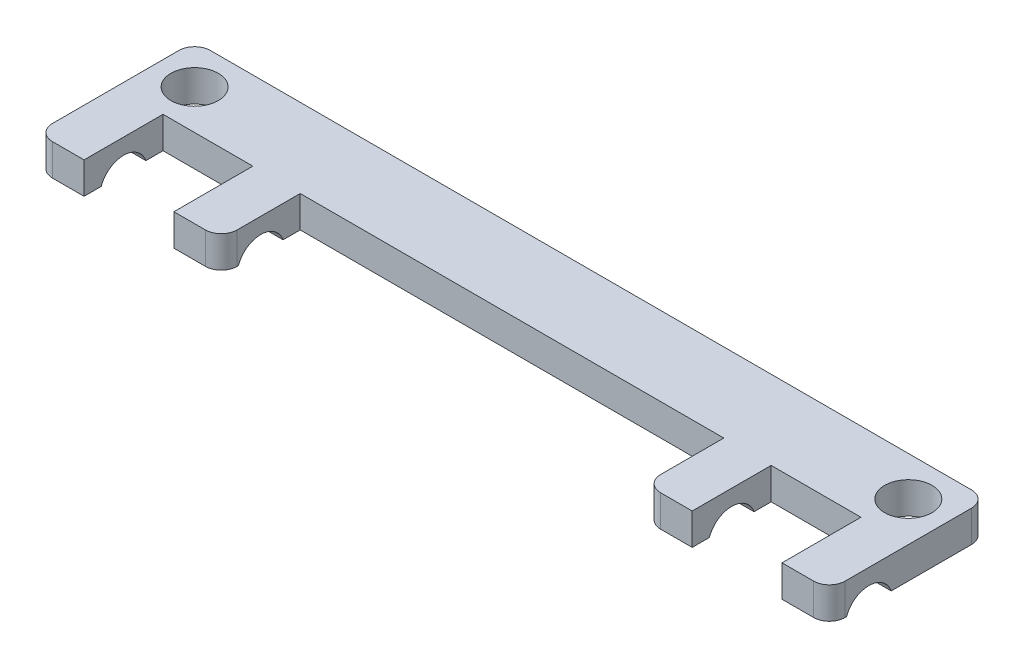
ISO-10303-21;
HEADER;
FILE_DESCRIPTION(('STEP AP214'),'2;1');
FILE_NAME('part.step','',(''),(''),'','','');
FILE_SCHEMA(('AUTOMOTIVE_DESIGN { 1 0 10303 214 1 1 1 1 }'));
ENDSEC;
DATA;
#1=APPLICATION_CONTEXT('core data for automotive mechanical design processes');
#2=APPLICATION_PROTOCOL_DEFINITION('international standard','automotive_design',2000,#1);
#3=PRODUCT_CONTEXT('',#1,'mechanical');
#4=PRODUCT('Part','Part','',(#3));
#5=PRODUCT_RELATED_PRODUCT_CATEGORY('part','',(#4));
#6=PRODUCT_DEFINITION_FORMATION('','',#4);
#7=PRODUCT_DEFINITION_CONTEXT('part definition',#1,'design');
#8=PRODUCT_DEFINITION('design','',#6,#7);
#9=PRODUCT_DEFINITION_SHAPE('','',#8);
#10=(LENGTH_UNIT() NAMED_UNIT(*) SI_UNIT(.MILLI.,.METRE.));
#11=(NAMED_UNIT(*) PLANE_ANGLE_UNIT() SI_UNIT($,.RADIAN.));
#12=(NAMED_UNIT(*) SI_UNIT($,.STERADIAN.) SOLID_ANGLE_UNIT());
#13=UNCERTAINTY_MEASURE_WITH_UNIT(LENGTH_MEASURE(1.E-05),#10,'distance_accuracy_value','');
#14=(GEOMETRIC_REPRESENTATION_CONTEXT(3) GLOBAL_UNCERTAINTY_ASSIGNED_CONTEXT((#13)) GLOBAL_UNIT_ASSIGNED_CONTEXT((#10,
#11,#12)) REPRESENTATION_CONTEXT('',''));
#15=CARTESIAN_POINT('',(0.,0.,0.));
#16=DIRECTION('',(0.,0.,1.));
#17=DIRECTION('',(1.,0.,0.));
#18=AXIS2_PLACEMENT_3D('',#15,#16,#17);
#19=CARTESIAN_POINT('',(0.,0.,0.));
#20=DIRECTION('',(0.,1.,0.));
#21=DIRECTION('',(0.,0.,1.));
#22=AXIS2_PLACEMENT_3D('',#19,#20,#21);
#23=PLANE('',#22);
#24=CARTESIAN_POINT('',(47.7,0.,-2.5));
#25=DIRECTION('',(0.,1.,0.));
#26=DIRECTION('',(0.,0.,1.));
#27=AXIS2_PLACEMENT_3D('',#24,#25,#26);
#28=CIRCLE('',#27,1.5);
#29=CARTESIAN_POINT('',(47.7,0.,-0.999999999999997));
#30=VERTEX_POINT('',#29);
#31=EDGE_CURVE('E295',#30,#30,#28,.T.);
#32=ORIENTED_EDGE('',*,*,#31,.T.);
#33=EDGE_LOOP('',(#32));
#34=FACE_BOUND('',#33,.T.);
#35=CARTESIAN_POINT('',(2.5,0.,-2.5));
#36=DIRECTION('',(0.,1.,0.));
#37=DIRECTION('',(0.,0.,1.));
#38=AXIS2_PLACEMENT_3D('',#35,#36,#37);
#39=CIRCLE('',#38,1.5);
#40=CARTESIAN_POINT('',(2.5,0.,-1.));
#41=VERTEX_POINT('',#40);
#42=EDGE_CURVE('E301',#41,#41,#39,.T.);
#43=ORIENTED_EDGE('',*,*,#42,.T.);
#44=EDGE_LOOP('',(#43));
#45=FACE_BOUND('',#44,.T.);
#46=DIRECTION('',(0.,0.,-1.));
#47=VECTOR('',#46,1.);
#48=CARTESIAN_POINT('',(0.,0.,0.));
#49=LINE('',#48,#47);
#50=CARTESIAN_POINT('',(0.,0.,1.08578643762691));
#51=VERTEX_POINT('',#50);
#52=CARTESIAN_POINT('',(0.,0.,-4.));
#53=VERTEX_POINT('',#52);
#54=EDGE_CURVE('E250',#51,#53,#49,.T.);
#55=ORIENTED_EDGE('',*,*,#54,.T.);
#56=CARTESIAN_POINT('',(1.,0.,-4.));
#57=DIRECTION('',(0.,1.,0.));
#58=DIRECTION('',(0.,0.,1.));
#59=AXIS2_PLACEMENT_3D('',#56,#57,#58);
#60=CIRCLE('',#59,1.);
#61=CARTESIAN_POINT('',(1.,0.,-5.));
#62=VERTEX_POINT('',#61);
#63=EDGE_CURVE('E481',#53,#62,#60,.F.);
#64=ORIENTED_EDGE('',*,*,#63,.T.);
#65=DIRECTION('',(1.,0.,0.));
#66=VECTOR('',#65,1.);
#67=CARTESIAN_POINT('',(0.,0.,-5.));
#68=LINE('',#67,#66);
#69=CARTESIAN_POINT('',(49.2,0.,-5.));
#70=VERTEX_POINT('',#69);
#71=EDGE_CURVE('E367',#62,#70,#68,.T.);
#72=ORIENTED_EDGE('',*,*,#71,.T.);
#73=CARTESIAN_POINT('',(49.2,0.,-4.));
#74=DIRECTION('',(0.,1.,0.));
#75=DIRECTION('',(0.,0.,1.));
#76=AXIS2_PLACEMENT_3D('',#73,#74,#75);
#77=CIRCLE('',#76,1.);
#78=CARTESIAN_POINT('',(50.2,0.,-4.));
#79=VERTEX_POINT('',#78);
#80=EDGE_CURVE('E478',#70,#79,#77,.F.);
#81=ORIENTED_EDGE('',*,*,#80,.T.);
#82=DIRECTION('',(0.,0.,-1.));
#83=VECTOR('',#82,1.);
#84=CARTESIAN_POINT('',(50.2,0.,0.));
#85=LINE('',#84,#83);
#86=CARTESIAN_POINT('',(50.2,0.,1.08578643762691));
#87=VERTEX_POINT('',#86);
#88=EDGE_CURVE('E422',#87,#79,#85,.T.);
#89=ORIENTED_EDGE('',*,*,#88,.F.);
#90=DIRECTION('',(-1.,0.,0.));
#91=VECTOR('',#90,1.);
#92=CARTESIAN_POINT('',(55.,0.,1.08578643762691));
#93=LINE('',#92,#91);
#94=CARTESIAN_POINT('',(47.2,0.,1.08578643762691));
#95=VERTEX_POINT('',#94);
#96=EDGE_CURVE('E471',#87,#95,#93,.T.);
#97=ORIENTED_EDGE('',*,*,#96,.T.);
#98=DIRECTION('',(0.,0.,1.));
#99=VECTOR('',#98,1.);
#100=CARTESIAN_POINT('',(47.2,0.,0.));
#101=LINE('',#100,#99);
#102=CARTESIAN_POINT('',(47.2,0.,0.));
#103=VERTEX_POINT('',#102);
#104=EDGE_CURVE('E414',#103,#95,#101,.T.);
#105=ORIENTED_EDGE('',*,*,#104,.F.);
#106=DIRECTION('',(1.,0.,0.));
#107=VECTOR('',#106,1.);
#108=CARTESIAN_POINT('',(0.,0.,0.));
#109=LINE('',#108,#107);
#110=CARTESIAN_POINT('',(41.5127142897757,0.,0.));
#111=VERTEX_POINT('',#110);
#112=EDGE_CURVE('E400',#111,#103,#109,.T.);
#113=ORIENTED_EDGE('',*,*,#112,.F.);
#114=DIRECTION('',(0.,0.,1.));
#115=VECTOR('',#114,1.);
#116=CARTESIAN_POINT('',(41.5127142897757,0.,0.));
#117=LINE('',#116,#115);
#118=CARTESIAN_POINT('',(41.5127142897757,0.,1.08578643762691));
#119=VERTEX_POINT('',#118);
#120=EDGE_CURVE('E410',#111,#119,#117,.T.);
#121=ORIENTED_EDGE('',*,*,#120,.T.);
#122=CARTESIAN_POINT('',(38.5127142897757,0.,1.08578643762691));
#123=VERTEX_POINT('',#122);
#124=EDGE_CURVE('E609',#119,#123,#93,.T.);
#125=ORIENTED_EDGE('',*,*,#124,.T.);
#126=DIRECTION('',(0.,0.,1.));
#127=VECTOR('',#126,1.);
#128=CARTESIAN_POINT('',(38.5127142897757,0.,0.));
#129=LINE('',#128,#127);
#130=CARTESIAN_POINT('',(38.5127142897757,0.,0.));
#131=VERTEX_POINT('',#130);
#132=EDGE_CURVE('E401',#131,#123,#129,.T.);
#133=ORIENTED_EDGE('',*,*,#132,.F.);
#134=CARTESIAN_POINT('',(11.6872857102243,0.,0.));
#135=VERTEX_POINT('',#134);
#136=EDGE_CURVE('E395',#135,#131,#109,.T.);
#137=ORIENTED_EDGE('',*,*,#136,.F.);
#138=DIRECTION('',(0.,0.,1.));
#139=VECTOR('',#138,1.);
#140=CARTESIAN_POINT('',(11.6872857102243,0.,0.));
#141=LINE('',#140,#139);
#142=CARTESIAN_POINT('',(11.6872857102243,0.,1.08578643762691));
#143=VERTEX_POINT('',#142);
#144=EDGE_CURVE('E391',#135,#143,#141,.T.);
#145=ORIENTED_EDGE('',*,*,#144,.T.);
#146=CARTESIAN_POINT('',(8.68728571022433,0.,1.08578643762691));
#147=VERTEX_POINT('',#146);
#148=EDGE_CURVE('E470',#143,#147,#93,.T.);
#149=ORIENTED_EDGE('',*,*,#148,.T.);
#150=DIRECTION('',(0.,0.,1.));
#151=VECTOR('',#150,1.);
#152=CARTESIAN_POINT('',(8.68728571022433,0.,0.));
#153=LINE('',#152,#151);
#154=CARTESIAN_POINT('',(8.68728571022433,0.,0.));
#155=VERTEX_POINT('',#154);
#156=EDGE_CURVE('E383',#155,#147,#153,.T.);
#157=ORIENTED_EDGE('',*,*,#156,.F.);
#158=DIRECTION('',(1.,0.,0.));
#159=VECTOR('',#158,1.);
#160=CARTESIAN_POINT('',(0.,0.,0.));
#161=LINE('',#160,#159);
#162=CARTESIAN_POINT('',(3.,0.,0.));
#163=VERTEX_POINT('',#162);
#164=EDGE_CURVE('E378',#163,#155,#161,.T.);
#165=ORIENTED_EDGE('',*,*,#164,.F.);
#166=DIRECTION('',(0.,0.,1.));
#167=VECTOR('',#166,1.);
#168=CARTESIAN_POINT('',(3.,0.,0.));
#169=LINE('',#168,#167);
#170=CARTESIAN_POINT('',(3.,0.,1.08578643762691));
#171=VERTEX_POINT('',#170);
#172=EDGE_CURVE('E374',#163,#171,#169,.T.);
#173=ORIENTED_EDGE('',*,*,#172,.T.);
#174=EDGE_CURVE('E259',#171,#51,#93,.T.);
#175=ORIENTED_EDGE('',*,*,#174,.T.);
#176=EDGE_LOOP('',(#55,#64,#72,#81,#89,#97,#105,#113,#121,#125,#133,#137,#145,#149,#157,#165,
#173,#175));
#177=FACE_BOUND('',#176,.T.);
#178=ADVANCED_FACE('F41',(#34,#45,#177),#23,.F.);
#179=DIRECTION('',(1.,0.,0.));
#180=VECTOR('',#179,1.);
#181=CARTESIAN_POINT('',(0.,0.,5.));
#182=LINE('',#181,#180);
#183=CARTESIAN_POINT('',(1.,0.,5.));
#184=VERTEX_POINT('',#183);
#185=CARTESIAN_POINT('',(3.,0.,5.));
#186=VERTEX_POINT('',#185);
#187=EDGE_CURVE('E249',#184,#186,#182,.T.);
#188=ORIENTED_EDGE('',*,*,#187,.F.);
#189=CARTESIAN_POINT('',(1.,0.,4.));
#190=DIRECTION('',(0.,1.,0.));
#191=DIRECTION('',(0.,0.,1.));
#192=AXIS2_PLACEMENT_3D('',#189,#190,#191);
#193=CIRCLE('',#192,1.);
#194=CARTESIAN_POINT('',(0.,0.,4.));
#195=VERTEX_POINT('',#194);
#196=EDGE_CURVE('E11',#184,#195,#193,.F.);
#197=ORIENTED_EDGE('',*,*,#196,.T.);
#198=CARTESIAN_POINT('',(0.,0.,3.9142135623731));
#199=VERTEX_POINT('',#198);
#200=EDGE_CURVE('E239',#195,#199,#49,.T.);
#201=ORIENTED_EDGE('',*,*,#200,.T.);
#202=DIRECTION('',(-1.,0.,0.));
#203=VECTOR('',#202,1.);
#204=CARTESIAN_POINT('',(55.,0.,3.9142135623731));
#205=LINE('',#204,#203);
#206=CARTESIAN_POINT('',(3.,0.,3.9142135623731));
#207=VERTEX_POINT('',#206);
#208=EDGE_CURVE('E244',#199,#207,#205,.F.);
#209=ORIENTED_EDGE('',*,*,#208,.T.);
#210=EDGE_CURVE('E373',#207,#186,#169,.T.);
#211=ORIENTED_EDGE('',*,*,#210,.T.);
#212=EDGE_LOOP('',(#188,#197,#201,#209,#211));
#213=FACE_BOUND('',#212,.T.);
#214=ADVANCED_FACE('F242',(#213),#23,.F.);
#215=CARTESIAN_POINT('',(11.6872857102243,0.,3.9142135623731));
#216=VERTEX_POINT('',#215);
#217=CARTESIAN_POINT('',(11.6872857102243,0.,4.));
#218=VERTEX_POINT('',#217);
#219=EDGE_CURVE('E390',#216,#218,#141,.T.);
#220=ORIENTED_EDGE('',*,*,#219,.T.);
#221=CARTESIAN_POINT('',(10.6872857102243,0.,4.));
#222=DIRECTION('',(0.,1.,0.));
#223=DIRECTION('',(0.,0.,1.));
#224=AXIS2_PLACEMENT_3D('',#221,#222,#223);
#225=CIRCLE('',#224,1.);
#226=CARTESIAN_POINT('',(10.6872857102243,0.,5.));
#227=VERTEX_POINT('',#226);
#228=EDGE_CURVE('E63',#218,#227,#225,.F.);
#229=ORIENTED_EDGE('',*,*,#228,.T.);
#230=DIRECTION('',(1.,0.,0.));
#231=VECTOR('',#230,1.);
#232=CARTESIAN_POINT('',(0.,0.,5.));
#233=LINE('',#232,#231);
#234=CARTESIAN_POINT('',(8.68728571022433,0.,5.));
#235=VERTEX_POINT('',#234);
#236=EDGE_CURVE('E387',#235,#227,#233,.T.);
#237=ORIENTED_EDGE('',*,*,#236,.F.);
#238=CARTESIAN_POINT('',(8.68728571022433,0.,3.9142135623731));
#239=VERTEX_POINT('',#238);
#240=EDGE_CURVE('E382',#239,#235,#153,.T.);
#241=ORIENTED_EDGE('',*,*,#240,.F.);
#242=EDGE_CURVE('E260',#239,#216,#205,.F.);
#243=ORIENTED_EDGE('',*,*,#242,.T.);
#244=EDGE_LOOP('',(#220,#229,#237,#241,#243));
#245=FACE_BOUND('',#244,.T.);
#246=ADVANCED_FACE('F595',(#245),#23,.F.);
#247=DIRECTION('',(-1.,0.,0.));
#248=VECTOR('',#247,1.);
#249=CARTESIAN_POINT('',(0.,0.,5.00000000000001));
#250=LINE('',#249,#248);
#251=CARTESIAN_POINT('',(41.5127142897757,0.,5.));
#252=VERTEX_POINT('',#251);
#253=CARTESIAN_POINT('',(39.5127142897757,0.,5.));
#254=VERTEX_POINT('',#253);
#255=EDGE_CURVE('E405',#252,#254,#250,.T.);
#256=ORIENTED_EDGE('',*,*,#255,.T.);
#257=CARTESIAN_POINT('',(39.5127142897757,0.,4.));
#258=DIRECTION('',(0.,1.,0.));
#259=DIRECTION('',(0.,0.,1.));
#260=AXIS2_PLACEMENT_3D('',#257,#258,#259);
#261=CIRCLE('',#260,1.);
#262=CARTESIAN_POINT('',(38.5127142897757,0.,3.99999999999999));
#263=VERTEX_POINT('',#262);
#264=EDGE_CURVE('E526',#254,#263,#261,.F.);
#265=ORIENTED_EDGE('',*,*,#264,.T.);
#266=CARTESIAN_POINT('',(38.5127142897757,0.,3.9142135623731));
#267=VERTEX_POINT('',#266);
#268=EDGE_CURVE('E399',#267,#263,#129,.T.);
#269=ORIENTED_EDGE('',*,*,#268,.F.);
#270=CARTESIAN_POINT('',(41.5127142897757,0.,3.9142135623731));
#271=VERTEX_POINT('',#270);
#272=EDGE_CURVE('E467',#267,#271,#205,.F.);
#273=ORIENTED_EDGE('',*,*,#272,.T.);
#274=EDGE_CURVE('E409',#271,#252,#117,.T.);
#275=ORIENTED_EDGE('',*,*,#274,.T.);
#276=EDGE_LOOP('',(#256,#265,#269,#273,#275));
#277=FACE_BOUND('',#276,.T.);
#278=ADVANCED_FACE('F634',(#277),#23,.F.);
#279=CARTESIAN_POINT('',(0.,2.,-5.));
#280=DIRECTION('',(0.,0.,-1.));
#281=DIRECTION('',(-1.,0.,0.));
#282=AXIS2_PLACEMENT_3D('',#279,#280,#281);
#283=PLANE('',#282);
#284=ORIENTED_EDGE('',*,*,#71,.F.);
#285=DIRECTION('',(0.,-1.,0.));
#286=VECTOR('',#285,1.);
#287=CARTESIAN_POINT('',(1.,2.,-5.));
#288=LINE('',#287,#286);
#289=CARTESIAN_POINT('',(1.,2.,-5.));
#290=VERTEX_POINT('',#289);
#291=EDGE_CURVE('E488',#62,#290,#288,.F.);
#292=ORIENTED_EDGE('',*,*,#291,.T.);
#293=DIRECTION('',(1.,0.,0.));
#294=VECTOR('',#293,1.);
#295=CARTESIAN_POINT('',(0.,2.,-5.));
#296=LINE('',#295,#294);
#297=CARTESIAN_POINT('',(49.2,2.,-5.));
#298=VERTEX_POINT('',#297);
#299=EDGE_CURVE('E300',#290,#298,#296,.T.);
#300=ORIENTED_EDGE('',*,*,#299,.T.);
#301=DIRECTION('',(0.,-1.,0.));
#302=VECTOR('',#301,1.);
#303=CARTESIAN_POINT('',(49.2,0.,-5.));
#304=LINE('',#303,#302);
#305=EDGE_CURVE('E484',#298,#70,#304,.T.);
#306=ORIENTED_EDGE('',*,*,#305,.T.);
#307=EDGE_LOOP('',(#284,#292,#300,#306));
#308=FACE_BOUND('',#307,.T.);
#309=ADVANCED_FACE('F566',(#308),#283,.T.);
#310=CARTESIAN_POINT('',(0.,2.,0.));
#311=DIRECTION('',(-1.,0.,0.));
#312=DIRECTION('',(0.,0.,1.));
#313=AXIS2_PLACEMENT_3D('',#310,#311,#312);
#314=PLANE('',#313);
#315=DIRECTION('',(0.,0.,-1.));
#316=VECTOR('',#315,1.);
#317=CARTESIAN_POINT('',(0.,2.,0.));
#318=LINE('',#317,#316);
#319=CARTESIAN_POINT('',(0.,2.,4.));
#320=VERTEX_POINT('',#319);
#321=CARTESIAN_POINT('',(0.,2.,-4.));
#322=VERTEX_POINT('',#321);
#323=EDGE_CURVE('E305',#320,#322,#318,.T.);
#324=ORIENTED_EDGE('',*,*,#323,.T.);
#325=DIRECTION('',(0.,-1.,0.));
#326=VECTOR('',#325,1.);
#327=CARTESIAN_POINT('',(0.,2.,-4.));
#328=LINE('',#327,#326);
#329=EDGE_CURVE('E475',#322,#53,#328,.T.);
#330=ORIENTED_EDGE('',*,*,#329,.T.);
#331=ORIENTED_EDGE('',*,*,#54,.F.);
#332=CARTESIAN_POINT('',(0.,-0.5,2.5));
#333=DIRECTION('',(-1.,0.,0.));
#334=DIRECTION('',(0.,0.,1.));
#335=AXIS2_PLACEMENT_3D('',#332,#333,#334);
#336=CIRCLE('',#335,1.5);
#337=EDGE_CURVE('E254',#199,#51,#336,.T.);
#338=ORIENTED_EDGE('',*,*,#337,.F.);
#339=ORIENTED_EDGE('',*,*,#200,.F.);
#340=DIRECTION('',(0.,-1.,0.));
#341=VECTOR('',#340,1.);
#342=CARTESIAN_POINT('',(0.,2.,4.));
#343=LINE('',#342,#341);
#344=EDGE_CURVE('E472',#195,#320,#343,.F.);
#345=ORIENTED_EDGE('',*,*,#344,.T.);
#346=EDGE_LOOP('',(#324,#330,#331,#338,#339,#345));
#347=FACE_BOUND('',#346,.T.);
#348=ADVANCED_FACE('F265',(#347),#314,.T.);
#349=CARTESIAN_POINT('',(0.,2.,5.));
#350=DIRECTION('',(0.,0.,-1.));
#351=DIRECTION('',(-1.,0.,0.));
#352=AXIS2_PLACEMENT_3D('',#349,#350,#351);
#353=PLANE('',#352);
#354=DIRECTION('',(1.,0.,0.));
#355=VECTOR('',#354,1.);
#356=CARTESIAN_POINT('',(0.,2.,5.));
#357=LINE('',#356,#355);
#358=CARTESIAN_POINT('',(1.,2.,5.));
#359=VERTEX_POINT('',#358);
#360=CARTESIAN_POINT('',(3.,2.,5.));
#361=VERTEX_POINT('',#360);
#362=EDGE_CURVE('E308',#359,#361,#357,.T.);
#363=ORIENTED_EDGE('',*,*,#362,.F.);
#364=DIRECTION('',(0.,-1.,0.));
#365=VECTOR('',#364,1.);
#366=CARTESIAN_POINT('',(1.,0.,5.));
#367=LINE('',#366,#365);
#368=EDGE_CURVE('E50',#359,#184,#367,.T.);
#369=ORIENTED_EDGE('',*,*,#368,.T.);
#370=ORIENTED_EDGE('',*,*,#187,.T.);
#371=DIRECTION('',(0.,-1.,0.));
#372=VECTOR('',#371,1.);
#373=CARTESIAN_POINT('',(3.,2.,5.));
#374=LINE('',#373,#372);
#375=EDGE_CURVE('E461',#361,#186,#374,.T.);
#376=ORIENTED_EDGE('',*,*,#375,.F.);
#377=EDGE_LOOP('',(#363,#369,#370,#376));
#378=FACE_BOUND('',#377,.T.);
#379=ADVANCED_FACE('F543',(#378),#353,.F.);
#380=CARTESIAN_POINT('',(3.,2.,0.));
#381=DIRECTION('',(1.,0.,0.));
#382=DIRECTION('',(0.,0.,-1.));
#383=AXIS2_PLACEMENT_3D('',#380,#381,#382);
#384=PLANE('',#383);
#385=CARTESIAN_POINT('',(3.,-0.5,2.5));
#386=DIRECTION('',(1.,0.,0.));
#387=DIRECTION('',(0.,0.,-1.));
#388=AXIS2_PLACEMENT_3D('',#385,#386,#387);
#389=CIRCLE('',#388,1.5);
#390=EDGE_CURVE('E257',#171,#207,#389,.T.);
#391=ORIENTED_EDGE('',*,*,#390,.F.);
#392=ORIENTED_EDGE('',*,*,#172,.F.);
#393=DIRECTION('',(0.,-1.,0.));
#394=VECTOR('',#393,1.);
#395=CARTESIAN_POINT('',(3.,2.,0.));
#396=LINE('',#395,#394);
#397=CARTESIAN_POINT('',(3.,2.,0.));
#398=VERTEX_POINT('',#397);
#399=EDGE_CURVE('E458',#398,#163,#396,.T.);
#400=ORIENTED_EDGE('',*,*,#399,.F.);
#401=DIRECTION('',(0.,0.,1.));
#402=VECTOR('',#401,1.);
#403=CARTESIAN_POINT('',(3.,2.,0.));
#404=LINE('',#403,#402);
#405=EDGE_CURVE('E311',#398,#361,#404,.T.);
#406=ORIENTED_EDGE('',*,*,#405,.T.);
#407=ORIENTED_EDGE('',*,*,#375,.T.);
#408=ORIENTED_EDGE('',*,*,#210,.F.);
#409=EDGE_LOOP('',(#391,#392,#400,#406,#407,#408));
#410=FACE_BOUND('',#409,.T.);
#411=ADVANCED_FACE('F548',(#410),#384,.T.);
#412=CARTESIAN_POINT('',(0.,2.,0.));
#413=DIRECTION('',(0.,0.,-1.));
#414=DIRECTION('',(-1.,0.,0.));
#415=AXIS2_PLACEMENT_3D('',#412,#413,#414);
#416=PLANE('',#415);
#417=ORIENTED_EDGE('',*,*,#164,.T.);
#418=DIRECTION('',(0.,-1.,0.));
#419=VECTOR('',#418,1.);
#420=CARTESIAN_POINT('',(8.68728571022433,2.,0.));
#421=LINE('',#420,#419);
#422=CARTESIAN_POINT('',(8.68728571022433,2.,0.));
#423=VERTEX_POINT('',#422);
#424=EDGE_CURVE('E454',#423,#155,#421,.T.);
#425=ORIENTED_EDGE('',*,*,#424,.F.);
#426=DIRECTION('',(1.,0.,0.));
#427=VECTOR('',#426,1.);
#428=CARTESIAN_POINT('',(0.,2.,0.));
#429=LINE('',#428,#427);
#430=EDGE_CURVE('E315',#398,#423,#429,.T.);
#431=ORIENTED_EDGE('',*,*,#430,.F.);
#432=ORIENTED_EDGE('',*,*,#399,.T.);
#433=EDGE_LOOP('',(#417,#425,#431,#432));
#434=FACE_BOUND('',#433,.T.);
#435=ADVANCED_FACE('F602',(#434),#416,.F.);
#436=CARTESIAN_POINT('',(8.68728571022433,2.,0.));
#437=DIRECTION('',(1.,0.,0.));
#438=DIRECTION('',(0.,0.,-1.));
#439=AXIS2_PLACEMENT_3D('',#436,#437,#438);
#440=PLANE('',#439);
#441=ORIENTED_EDGE('',*,*,#156,.T.);
#442=CARTESIAN_POINT('',(8.68728571022433,-0.5,2.5));
#443=DIRECTION('',(1.,0.,0.));
#444=DIRECTION('',(0.,0.,-1.));
#445=AXIS2_PLACEMENT_3D('',#442,#443,#444);
#446=CIRCLE('',#445,1.5);
#447=EDGE_CURVE('E289',#147,#239,#446,.T.);
#448=ORIENTED_EDGE('',*,*,#447,.T.);
#449=ORIENTED_EDGE('',*,*,#240,.T.);
#450=DIRECTION('',(0.,-1.,0.));
#451=VECTOR('',#450,1.);
#452=CARTESIAN_POINT('',(8.68728571022433,2.,5.));
#453=LINE('',#452,#451);
#454=CARTESIAN_POINT('',(8.68728571022433,2.,5.));
#455=VERTEX_POINT('',#454);
#456=EDGE_CURVE('E450',#455,#235,#453,.T.);
#457=ORIENTED_EDGE('',*,*,#456,.F.);
#458=DIRECTION('',(0.,0.,1.));
#459=VECTOR('',#458,1.);
#460=CARTESIAN_POINT('',(8.68728571022433,2.,0.));
#461=LINE('',#460,#459);
#462=EDGE_CURVE('E319',#423,#455,#461,.T.);
#463=ORIENTED_EDGE('',*,*,#462,.F.);
#464=ORIENTED_EDGE('',*,*,#424,.T.);
#465=EDGE_LOOP('',(#441,#448,#449,#457,#463,#464));
#466=FACE_BOUND('',#465,.T.);
#467=ADVANCED_FACE('F593',(#466),#440,.F.);
#468=CARTESIAN_POINT('',(0.,2.,5.));
#469=DIRECTION('',(0.,0.,-1.));
#470=DIRECTION('',(-1.,0.,0.));
#471=AXIS2_PLACEMENT_3D('',#468,#469,#470);
#472=PLANE('',#471);
#473=ORIENTED_EDGE('',*,*,#236,.T.);
#474=DIRECTION('',(0.,-1.,0.));
#475=VECTOR('',#474,1.);
#476=CARTESIAN_POINT('',(10.6872857102243,2.,5.));
#477=LINE('',#476,#475);
#478=CARTESIAN_POINT('',(10.6872857102243,2.,5.));
#479=VERTEX_POINT('',#478);
#480=EDGE_CURVE('E538',#227,#479,#477,.F.);
#481=ORIENTED_EDGE('',*,*,#480,.T.);
#482=DIRECTION('',(1.,0.,0.));
#483=VECTOR('',#482,1.);
#484=CARTESIAN_POINT('',(0.,2.,5.));
#485=LINE('',#484,#483);
#486=EDGE_CURVE('E323',#455,#479,#485,.T.);
#487=ORIENTED_EDGE('',*,*,#486,.F.);
#488=ORIENTED_EDGE('',*,*,#456,.T.);
#489=EDGE_LOOP('',(#473,#481,#487,#488));
#490=FACE_BOUND('',#489,.T.);
#491=ADVANCED_FACE('F598',(#490),#472,.F.);
#492=CARTESIAN_POINT('',(11.6872857102243,2.,0.));
#493=DIRECTION('',(1.,0.,0.));
#494=DIRECTION('',(0.,0.,-1.));
#495=AXIS2_PLACEMENT_3D('',#492,#493,#494);
#496=PLANE('',#495);
#497=DIRECTION('',(0.,0.,1.));
#498=VECTOR('',#497,1.);
#499=CARTESIAN_POINT('',(11.6872857102243,2.,0.));
#500=LINE('',#499,#498);
#501=CARTESIAN_POINT('',(11.6872857102243,2.,0.));
#502=VERTEX_POINT('',#501);
#503=CARTESIAN_POINT('',(11.6872857102243,2.,4.));
#504=VERTEX_POINT('',#503);
#505=EDGE_CURVE('E327',#502,#504,#500,.T.);
#506=ORIENTED_EDGE('',*,*,#505,.T.);
#507=DIRECTION('',(0.,-1.,0.));
#508=VECTOR('',#507,1.);
#509=CARTESIAN_POINT('',(11.6872857102243,0.,4.));
#510=LINE('',#509,#508);
#511=EDGE_CURVE('E532',#504,#218,#510,.T.);
#512=ORIENTED_EDGE('',*,*,#511,.T.);
#513=ORIENTED_EDGE('',*,*,#219,.F.);
#514=CARTESIAN_POINT('',(11.6872857102243,-0.5,2.5));
#515=DIRECTION('',(1.,0.,0.));
#516=DIRECTION('',(0.,0.,-1.));
#517=AXIS2_PLACEMENT_3D('',#514,#515,#516);
#518=CIRCLE('',#517,1.5);
#519=EDGE_CURVE('E286',#143,#216,#518,.T.);
#520=ORIENTED_EDGE('',*,*,#519,.F.);
#521=ORIENTED_EDGE('',*,*,#144,.F.);
#522=DIRECTION('',(0.,-1.,0.));
#523=VECTOR('',#522,1.);
#524=CARTESIAN_POINT('',(11.6872857102243,2.,0.));
#525=LINE('',#524,#523);
#526=EDGE_CURVE('E447',#502,#135,#525,.T.);
#527=ORIENTED_EDGE('',*,*,#526,.F.);
#528=EDGE_LOOP('',(#506,#512,#513,#520,#521,#527));
#529=FACE_BOUND('',#528,.T.);
#530=ADVANCED_FACE('F639',(#529),#496,.T.);
#531=CARTESIAN_POINT('',(0.,2.,0.));
#532=DIRECTION('',(0.,0.,-1.));
#533=DIRECTION('',(-1.,0.,0.));
#534=AXIS2_PLACEMENT_3D('',#531,#532,#533);
#535=PLANE('',#534);
#536=ORIENTED_EDGE('',*,*,#136,.T.);
#537=DIRECTION('',(0.,-1.,0.));
#538=VECTOR('',#537,1.);
#539=CARTESIAN_POINT('',(38.5127142897757,2.,0.));
#540=LINE('',#539,#538);
#541=CARTESIAN_POINT('',(38.5127142897757,2.,0.));
#542=VERTEX_POINT('',#541);
#543=EDGE_CURVE('E443',#542,#131,#540,.T.);
#544=ORIENTED_EDGE('',*,*,#543,.F.);
#545=DIRECTION('',(1.,0.,0.));
#546=VECTOR('',#545,1.);
#547=CARTESIAN_POINT('',(0.,2.,0.));
#548=LINE('',#547,#546);
#549=EDGE_CURVE('E331',#502,#542,#548,.T.);
#550=ORIENTED_EDGE('',*,*,#549,.F.);
#551=ORIENTED_EDGE('',*,*,#526,.T.);
#552=EDGE_LOOP('',(#536,#544,#550,#551));
#553=FACE_BOUND('',#552,.T.);
#554=ADVANCED_FACE('F648',(#553),#535,.F.);
#555=CARTESIAN_POINT('',(38.5127142897757,2.,0.));
#556=DIRECTION('',(1.,0.,0.));
#557=DIRECTION('',(0.,0.,-1.));
#558=AXIS2_PLACEMENT_3D('',#555,#556,#557);
#559=PLANE('',#558);
#560=ORIENTED_EDGE('',*,*,#268,.T.);
#561=DIRECTION('',(0.,-1.,0.));
#562=VECTOR('',#561,1.);
#563=CARTESIAN_POINT('',(38.5127142897757,2.,3.99999999999999));
#564=LINE('',#563,#562);
#565=CARTESIAN_POINT('',(38.5127142897757,2.,3.99999999999999));
#566=VERTEX_POINT('',#565);
#567=EDGE_CURVE('E529',#263,#566,#564,.F.);
#568=ORIENTED_EDGE('',*,*,#567,.T.);
#569=DIRECTION('',(0.,0.,1.));
#570=VECTOR('',#569,1.);
#571=CARTESIAN_POINT('',(38.5127142897757,2.,0.));
#572=LINE('',#571,#570);
#573=EDGE_CURVE('E335',#542,#566,#572,.T.);
#574=ORIENTED_EDGE('',*,*,#573,.F.);
#575=ORIENTED_EDGE('',*,*,#543,.T.);
#576=ORIENTED_EDGE('',*,*,#132,.T.);
#577=CARTESIAN_POINT('',(38.5127142897757,-0.5,2.5));
#578=DIRECTION('',(1.,0.,0.));
#579=DIRECTION('',(0.,0.,-1.));
#580=AXIS2_PLACEMENT_3D('',#577,#578,#579);
#581=CIRCLE('',#580,1.5);
#582=EDGE_CURVE('E282',#123,#267,#581,.T.);
#583=ORIENTED_EDGE('',*,*,#582,.T.);
#584=EDGE_LOOP('',(#560,#568,#574,#575,#576,#583));
#585=FACE_BOUND('',#584,.T.);
#586=ADVANCED_FACE('F650',(#585),#559,.F.);
#587=CARTESIAN_POINT('',(0.,2.,5.00000000000001));
#588=DIRECTION('',(0.,0.,1.));
#589=DIRECTION('',(1.,0.,0.));
#590=AXIS2_PLACEMENT_3D('',#587,#588,#589);
#591=PLANE('',#590);
#592=DIRECTION('',(-1.,0.,0.));
#593=VECTOR('',#592,1.);
#594=CARTESIAN_POINT('',(0.,2.,5.00000000000001));
#595=LINE('',#594,#593);
#596=CARTESIAN_POINT('',(41.5127142897757,2.,5.));
#597=VERTEX_POINT('',#596);
#598=CARTESIAN_POINT('',(39.5127142897757,2.,5.));
#599=VERTEX_POINT('',#598);
#600=EDGE_CURVE('E340',#597,#599,#595,.T.);
#601=ORIENTED_EDGE('',*,*,#600,.T.);
#602=DIRECTION('',(0.,-1.,0.));
#603=VECTOR('',#602,1.);
#604=CARTESIAN_POINT('',(39.5127142897757,0.,5.));
#605=LINE('',#604,#603);
#606=EDGE_CURVE('E522',#599,#254,#605,.T.);
#607=ORIENTED_EDGE('',*,*,#606,.T.);
#608=ORIENTED_EDGE('',*,*,#255,.F.);
#609=DIRECTION('',(0.,-1.,0.));
#610=VECTOR('',#609,1.);
#611=CARTESIAN_POINT('',(41.5127142897757,2.,5.));
#612=LINE('',#611,#610);
#613=EDGE_CURVE('E439',#597,#252,#612,.T.);
#614=ORIENTED_EDGE('',*,*,#613,.F.);
#615=EDGE_LOOP('',(#601,#607,#608,#614));
#616=FACE_BOUND('',#615,.T.);
#617=ADVANCED_FACE('F658',(#616),#591,.T.);
#618=CARTESIAN_POINT('',(41.5127142897757,2.,0.));
#619=DIRECTION('',(1.,0.,0.));
#620=DIRECTION('',(0.,0.,-1.));
#621=AXIS2_PLACEMENT_3D('',#618,#619,#620);
#622=PLANE('',#621);
#623=CARTESIAN_POINT('',(41.5127142897757,-0.5,2.5));
#624=DIRECTION('',(1.,0.,0.));
#625=DIRECTION('',(0.,0.,-1.));
#626=AXIS2_PLACEMENT_3D('',#623,#624,#625);
#627=CIRCLE('',#626,1.5);
#628=EDGE_CURVE('E279',#119,#271,#627,.T.);
#629=ORIENTED_EDGE('',*,*,#628,.F.);
#630=ORIENTED_EDGE('',*,*,#120,.F.);
#631=DIRECTION('',(0.,-1.,0.));
#632=VECTOR('',#631,1.);
#633=CARTESIAN_POINT('',(41.5127142897757,2.,0.));
#634=LINE('',#633,#632);
#635=CARTESIAN_POINT('',(41.5127142897757,2.,0.));
#636=VERTEX_POINT('',#635);
#637=EDGE_CURVE('E436',#636,#111,#634,.T.);
#638=ORIENTED_EDGE('',*,*,#637,.F.);
#639=DIRECTION('',(0.,0.,1.));
#640=VECTOR('',#639,1.);
#641=CARTESIAN_POINT('',(41.5127142897757,2.,0.));
#642=LINE('',#641,#640);
#643=EDGE_CURVE('E344',#636,#597,#642,.T.);
#644=ORIENTED_EDGE('',*,*,#643,.T.);
#645=ORIENTED_EDGE('',*,*,#613,.T.);
#646=ORIENTED_EDGE('',*,*,#274,.F.);
#647=EDGE_LOOP('',(#629,#630,#638,#644,#645,#646));
#648=FACE_BOUND('',#647,.T.);
#649=ADVANCED_FACE('F627',(#648),#622,.T.);
#650=ORIENTED_EDGE('',*,*,#112,.T.);
#651=DIRECTION('',(0.,-1.,0.));
#652=VECTOR('',#651,1.);
#653=CARTESIAN_POINT('',(47.2,2.,0.));
#654=LINE('',#653,#652);
#655=CARTESIAN_POINT('',(47.2,2.,0.));
#656=VERTEX_POINT('',#655);
#657=EDGE_CURVE('E432',#656,#103,#654,.T.);
#658=ORIENTED_EDGE('',*,*,#657,.F.);
#659=EDGE_CURVE('E336',#636,#656,#548,.T.);
#660=ORIENTED_EDGE('',*,*,#659,.F.);
#661=ORIENTED_EDGE('',*,*,#637,.T.);
#662=EDGE_LOOP('',(#650,#658,#660,#661));
#663=FACE_BOUND('',#662,.T.);
#664=ADVANCED_FACE('F623',(#663),#535,.F.);
#665=CARTESIAN_POINT('',(47.2,2.,0.));
#666=DIRECTION('',(1.,0.,0.));
#667=DIRECTION('',(0.,0.,-1.));
#668=AXIS2_PLACEMENT_3D('',#665,#666,#667);
#669=PLANE('',#668);
#670=ORIENTED_EDGE('',*,*,#104,.T.);
#671=CARTESIAN_POINT('',(47.2,-0.5,2.5));
#672=DIRECTION('',(1.,0.,0.));
#673=DIRECTION('',(0.,0.,-1.));
#674=AXIS2_PLACEMENT_3D('',#671,#672,#673);
#675=CIRCLE('',#674,1.5);
#676=CARTESIAN_POINT('',(47.2,0.,3.9142135623731));
#677=VERTEX_POINT('',#676);
#678=EDGE_CURVE('E273',#95,#677,#675,.T.);
#679=ORIENTED_EDGE('',*,*,#678,.T.);
#680=CARTESIAN_POINT('',(47.2,0.,4.99999999999999));
#681=VERTEX_POINT('',#680);
#682=EDGE_CURVE('E419',#677,#681,#101,.T.);
#683=ORIENTED_EDGE('',*,*,#682,.T.);
#684=DIRECTION('',(0.,-1.,0.));
#685=VECTOR('',#684,1.);
#686=CARTESIAN_POINT('',(47.2,2.,4.99999999999999));
#687=LINE('',#686,#685);
#688=CARTESIAN_POINT('',(47.2,2.,4.99999999999999));
#689=VERTEX_POINT('',#688);
#690=EDGE_CURVE('E363',#689,#681,#687,.T.);
#691=ORIENTED_EDGE('',*,*,#690,.F.);
#692=DIRECTION('',(0.,0.,1.));
#693=VECTOR('',#692,1.);
#694=CARTESIAN_POINT('',(47.2,2.,0.));
#695=LINE('',#694,#693);
#696=EDGE_CURVE('E348',#656,#689,#695,.T.);
#697=ORIENTED_EDGE('',*,*,#696,.F.);
#698=ORIENTED_EDGE('',*,*,#657,.T.);
#699=EDGE_LOOP('',(#670,#679,#683,#691,#697,#698));
#700=FACE_BOUND('',#699,.T.);
#701=ADVANCED_FACE('F616',(#700),#669,.F.);
#702=CARTESIAN_POINT('',(0.,2.,5.00000000000001));
#703=DIRECTION('',(0.,0.,1.));
#704=DIRECTION('',(1.,0.,0.));
#705=AXIS2_PLACEMENT_3D('',#702,#703,#704);
#706=PLANE('',#705);
#707=DIRECTION('',(-1.,0.,0.));
#708=VECTOR('',#707,1.);
#709=CARTESIAN_POINT('',(0.,0.,5.00000000000001));
#710=LINE('',#709,#708);
#711=CARTESIAN_POINT('',(49.2,0.,4.99999999999999));
#712=VERTEX_POINT('',#711);
#713=EDGE_CURVE('E418',#712,#681,#710,.T.);
#714=ORIENTED_EDGE('',*,*,#713,.F.);
#715=DIRECTION('',(0.,-1.,0.));
#716=VECTOR('',#715,1.);
#717=CARTESIAN_POINT('',(49.2,2.,4.99999999999999));
#718=LINE('',#717,#716);
#719=CARTESIAN_POINT('',(49.2,2.,4.99999999999999));
#720=VERTEX_POINT('',#719);
#721=EDGE_CURVE('E519',#712,#720,#718,.F.);
#722=ORIENTED_EDGE('',*,*,#721,.T.);
#723=DIRECTION('',(-1.,0.,0.));
#724=VECTOR('',#723,1.);
#725=CARTESIAN_POINT('',(0.,2.,5.00000000000001));
#726=LINE('',#725,#724);
#727=EDGE_CURVE('E352',#720,#689,#726,.T.);
#728=ORIENTED_EDGE('',*,*,#727,.T.);
#729=ORIENTED_EDGE('',*,*,#690,.T.);
#730=EDGE_LOOP('',(#714,#722,#728,#729));
#731=FACE_BOUND('',#730,.T.);
#732=ADVANCED_FACE('F665',(#731),#706,.T.);
#733=CARTESIAN_POINT('',(50.2,2.,0.));
#734=DIRECTION('',(-1.,0.,0.));
#735=DIRECTION('',(0.,0.,1.));
#736=AXIS2_PLACEMENT_3D('',#733,#734,#735);
#737=PLANE('',#736);
#738=ORIENTED_EDGE('',*,*,#88,.T.);
#739=DIRECTION('',(0.,-1.,0.));
#740=VECTOR('',#739,1.);
#741=CARTESIAN_POINT('',(50.2,2.,-4.));
#742=LINE('',#741,#740);
#743=CARTESIAN_POINT('',(50.2,2.,-4.));
#744=VERTEX_POINT('',#743);
#745=EDGE_CURVE('E513',#79,#744,#742,.F.);
#746=ORIENTED_EDGE('',*,*,#745,.T.);
#747=DIRECTION('',(0.,0.,-1.));
#748=VECTOR('',#747,1.);
#749=CARTESIAN_POINT('',(50.2,2.,0.));
#750=LINE('',#749,#748);
#751=CARTESIAN_POINT('',(50.2,2.,3.99999999999999));
#752=VERTEX_POINT('',#751);
#753=EDGE_CURVE('E355',#752,#744,#750,.T.);
#754=ORIENTED_EDGE('',*,*,#753,.F.);
#755=DIRECTION('',(0.,-1.,0.));
#756=VECTOR('',#755,1.);
#757=CARTESIAN_POINT('',(50.2,0.,3.99999999999999));
#758=LINE('',#757,#756);
#759=CARTESIAN_POINT('',(50.2,0.,3.99999999999999));
#760=VERTEX_POINT('',#759);
#761=EDGE_CURVE('E509',#752,#760,#758,.T.);
#762=ORIENTED_EDGE('',*,*,#761,.T.);
#763=CARTESIAN_POINT('',(50.2,0.,3.9142135623731));
#764=VERTEX_POINT('',#763);
#765=EDGE_CURVE('E423',#760,#764,#85,.T.);
#766=ORIENTED_EDGE('',*,*,#765,.T.);
#767=CARTESIAN_POINT('',(50.2,-0.5,2.5));
#768=DIRECTION('',(-1.,0.,0.));
#769=DIRECTION('',(0.,0.,1.));
#770=AXIS2_PLACEMENT_3D('',#767,#768,#769);
#771=CIRCLE('',#770,1.5);
#772=EDGE_CURVE('E269',#764,#87,#771,.T.);
#773=ORIENTED_EDGE('',*,*,#772,.T.);
#774=EDGE_LOOP('',(#738,#746,#754,#762,#766,#773));
#775=FACE_BOUND('',#774,.T.);
#776=ADVANCED_FACE('F576',(#775),#737,.F.);
#777=CARTESIAN_POINT('',(47.7,2.,-2.5));
#778=DIRECTION('',(0.,-1.,0.));
#779=DIRECTION('',(0.,0.,-1.));
#780=AXIS2_PLACEMENT_3D('',#777,#778,#779);
#781=CYLINDRICAL_SURFACE('',#780,1.5);
#782=CARTESIAN_POINT('',(47.7,2.,-2.5));
#783=DIRECTION('',(0.,1.,0.));
#784=DIRECTION('',(0.,0.,1.));
#785=AXIS2_PLACEMENT_3D('',#782,#783,#784);
#786=CIRCLE('',#785,1.5);
#787=CARTESIAN_POINT('',(47.7,2.,-0.999999999999997));
#788=VERTEX_POINT('',#787);
#789=EDGE_CURVE('E296',#788,#788,#786,.T.);
#790=ORIENTED_EDGE('',*,*,#789,.T.);
#791=EDGE_LOOP('',(#790));
#792=FACE_BOUND('',#791,.T.);
#793=ORIENTED_EDGE('',*,*,#31,.F.);
#794=EDGE_LOOP('',(#793));
#795=FACE_BOUND('',#794,.T.);
#796=ADVANCED_FACE('F694',(#792,#795),#781,.F.);
#797=CARTESIAN_POINT('',(2.5,2.,-2.5));
#798=DIRECTION('',(0.,-1.,0.));
#799=DIRECTION('',(0.,0.,-1.));
#800=AXIS2_PLACEMENT_3D('',#797,#798,#799);
#801=CYLINDRICAL_SURFACE('',#800,1.5);
#802=CARTESIAN_POINT('',(2.5,2.,-2.5));
#803=DIRECTION('',(0.,1.,0.));
#804=DIRECTION('',(0.,0.,1.));
#805=AXIS2_PLACEMENT_3D('',#802,#803,#804);
#806=CIRCLE('',#805,1.5);
#807=CARTESIAN_POINT('',(2.5,2.,-1.));
#808=VERTEX_POINT('',#807);
#809=EDGE_CURVE('E359',#808,#808,#806,.T.);
#810=ORIENTED_EDGE('',*,*,#809,.T.);
#811=EDGE_LOOP('',(#810));
#812=FACE_BOUND('',#811,.T.);
#813=ORIENTED_EDGE('',*,*,#42,.F.);
#814=EDGE_LOOP('',(#813));
#815=FACE_BOUND('',#814,.T.);
#816=ADVANCED_FACE('F691',(#812,#815),#801,.F.);
#817=CARTESIAN_POINT('',(0.,2.,0.));
#818=DIRECTION('',(0.,1.,0.));
#819=DIRECTION('',(0.,0.,1.));
#820=AXIS2_PLACEMENT_3D('',#817,#818,#819);
#821=PLANE('',#820);
#822=ORIENTED_EDGE('',*,*,#789,.F.);
#823=EDGE_LOOP('',(#822));
#824=FACE_BOUND('',#823,.T.);
#825=ORIENTED_EDGE('',*,*,#299,.F.);
#826=CARTESIAN_POINT('',(1.,2.,-4.));
#827=DIRECTION('',(0.,1.,0.));
#828=DIRECTION('',(0.,0.,1.));
#829=AXIS2_PLACEMENT_3D('',#826,#827,#828);
#830=CIRCLE('',#829,1.);
#831=EDGE_CURVE('E506',#290,#322,#830,.T.);
#832=ORIENTED_EDGE('',*,*,#831,.T.);
#833=ORIENTED_EDGE('',*,*,#323,.F.);
#834=CARTESIAN_POINT('',(1.,2.,4.));
#835=DIRECTION('',(0.,1.,0.));
#836=DIRECTION('',(0.,0.,1.));
#837=AXIS2_PLACEMENT_3D('',#834,#835,#836);
#838=CIRCLE('',#837,1.);
#839=EDGE_CURVE('E491',#320,#359,#838,.T.);
#840=ORIENTED_EDGE('',*,*,#839,.T.);
#841=ORIENTED_EDGE('',*,*,#362,.T.);
#842=ORIENTED_EDGE('',*,*,#405,.F.);
#843=ORIENTED_EDGE('',*,*,#430,.T.);
#844=ORIENTED_EDGE('',*,*,#462,.T.);
#845=ORIENTED_EDGE('',*,*,#486,.T.);
#846=CARTESIAN_POINT('',(10.6872857102243,2.,4.));
#847=DIRECTION('',(0.,1.,0.));
#848=DIRECTION('',(0.,0.,1.));
#849=AXIS2_PLACEMENT_3D('',#846,#847,#848);
#850=CIRCLE('',#849,1.);
#851=EDGE_CURVE('E494',#479,#504,#850,.T.);
#852=ORIENTED_EDGE('',*,*,#851,.T.);
#853=ORIENTED_EDGE('',*,*,#505,.F.);
#854=ORIENTED_EDGE('',*,*,#549,.T.);
#855=ORIENTED_EDGE('',*,*,#573,.T.);
#856=CARTESIAN_POINT('',(39.5127142897757,2.,4.));
#857=DIRECTION('',(0.,1.,0.));
#858=DIRECTION('',(0.,0.,1.));
#859=AXIS2_PLACEMENT_3D('',#856,#857,#858);
#860=CIRCLE('',#859,1.);
#861=EDGE_CURVE('E497',#566,#599,#860,.T.);
#862=ORIENTED_EDGE('',*,*,#861,.T.);
#863=ORIENTED_EDGE('',*,*,#600,.F.);
#864=ORIENTED_EDGE('',*,*,#643,.F.);
#865=ORIENTED_EDGE('',*,*,#659,.T.);
#866=ORIENTED_EDGE('',*,*,#696,.T.);
#867=ORIENTED_EDGE('',*,*,#727,.F.);
#868=CARTESIAN_POINT('',(49.2,2.,3.99999999999999));
#869=DIRECTION('',(0.,1.,0.));
#870=DIRECTION('',(0.,0.,1.));
#871=AXIS2_PLACEMENT_3D('',#868,#869,#870);
#872=CIRCLE('',#871,1.);
#873=EDGE_CURVE('E500',#720,#752,#872,.T.);
#874=ORIENTED_EDGE('',*,*,#873,.T.);
#875=ORIENTED_EDGE('',*,*,#753,.T.);
#876=CARTESIAN_POINT('',(49.2,2.,-4.));
#877=DIRECTION('',(0.,1.,0.));
#878=DIRECTION('',(0.,0.,1.));
#879=AXIS2_PLACEMENT_3D('',#876,#877,#878);
#880=CIRCLE('',#879,1.);
#881=EDGE_CURVE('E503',#744,#298,#880,.T.);
#882=ORIENTED_EDGE('',*,*,#881,.T.);
#883=EDGE_LOOP('',(#825,#832,#833,#840,#841,#842,#843,#844,#845,#852,#853,#854,#855,#862,#863,
#864,#865,#866,#867,#874,#875,#882));
#884=FACE_BOUND('',#883,.T.);
#885=ORIENTED_EDGE('',*,*,#809,.F.);
#886=EDGE_LOOP('',(#885));
#887=FACE_BOUND('',#886,.T.);
#888=ADVANCED_FACE('F554',(#824,#884,#887),#821,.T.);
#889=ORIENTED_EDGE('',*,*,#765,.F.);
#890=CARTESIAN_POINT('',(49.2,0.,3.99999999999999));
#891=DIRECTION('',(0.,1.,0.));
#892=DIRECTION('',(0.,0.,1.));
#893=AXIS2_PLACEMENT_3D('',#890,#891,#892);
#894=CIRCLE('',#893,1.);
#895=EDGE_CURVE('E516',#760,#712,#894,.F.);
#896=ORIENTED_EDGE('',*,*,#895,.T.);
#897=ORIENTED_EDGE('',*,*,#713,.T.);
#898=ORIENTED_EDGE('',*,*,#682,.F.);
#899=EDGE_CURVE('E262',#677,#764,#205,.F.);
#900=ORIENTED_EDGE('',*,*,#899,.T.);
#901=EDGE_LOOP('',(#889,#896,#897,#898,#900));
#902=FACE_BOUND('',#901,.T.);
#903=ADVANCED_FACE('F672',(#902),#23,.F.);
#904=CARTESIAN_POINT('',(55.,-0.5,2.5));
#905=DIRECTION('',(-1.,0.,0.));
#906=DIRECTION('',(0.,0.,1.));
#907=AXIS2_PLACEMENT_3D('',#904,#905,#906);
#908=CYLINDRICAL_SURFACE('',#907,1.5);
#909=ORIENTED_EDGE('',*,*,#96,.F.);
#910=ORIENTED_EDGE('',*,*,#772,.F.);
#911=ORIENTED_EDGE('',*,*,#899,.F.);
#912=ORIENTED_EDGE('',*,*,#678,.F.);
#913=EDGE_LOOP('',(#909,#910,#911,#912));
#914=FACE_BOUND('',#913,.T.);
#915=ADVANCED_FACE('F673',(#914),#908,.F.);
#916=ORIENTED_EDGE('',*,*,#124,.F.);
#917=ORIENTED_EDGE('',*,*,#628,.T.);
#918=ORIENTED_EDGE('',*,*,#272,.F.);
#919=ORIENTED_EDGE('',*,*,#582,.F.);
#920=EDGE_LOOP('',(#916,#917,#918,#919));
#921=FACE_BOUND('',#920,.T.);
#922=ADVANCED_FACE('F631',(#921),#908,.F.);
#923=ORIENTED_EDGE('',*,*,#148,.F.);
#924=ORIENTED_EDGE('',*,*,#519,.T.);
#925=ORIENTED_EDGE('',*,*,#242,.F.);
#926=ORIENTED_EDGE('',*,*,#447,.F.);
#927=EDGE_LOOP('',(#923,#924,#925,#926));
#928=FACE_BOUND('',#927,.T.);
#929=ADVANCED_FACE('F680',(#928),#908,.F.);
#930=ORIENTED_EDGE('',*,*,#390,.T.);
#931=ORIENTED_EDGE('',*,*,#208,.F.);
#932=ORIENTED_EDGE('',*,*,#337,.T.);
#933=ORIENTED_EDGE('',*,*,#174,.F.);
#934=EDGE_LOOP('',(#930,#931,#932,#933));
#935=FACE_BOUND('',#934,.T.);
#936=ADVANCED_FACE('F253',(#935),#908,.F.);
#937=CARTESIAN_POINT('',(1.,2.,-4.));
#938=DIRECTION('',(0.,-1.,0.));
#939=DIRECTION('',(0.,0.,-1.));
#940=AXIS2_PLACEMENT_3D('',#937,#938,#939);
#941=CYLINDRICAL_SURFACE('',#940,1.);
#942=ORIENTED_EDGE('',*,*,#831,.F.);
#943=ORIENTED_EDGE('',*,*,#291,.F.);
#944=ORIENTED_EDGE('',*,*,#63,.F.);
#945=ORIENTED_EDGE('',*,*,#329,.F.);
#946=EDGE_LOOP('',(#942,#943,#944,#945));
#947=FACE_BOUND('',#946,.T.);
#948=ADVANCED_FACE('F561',(#947),#941,.T.);
#949=CARTESIAN_POINT('',(49.2,2.,-4.));
#950=DIRECTION('',(0.,1.,0.));
#951=DIRECTION('',(0.,0.,1.));
#952=AXIS2_PLACEMENT_3D('',#949,#950,#951);
#953=CYLINDRICAL_SURFACE('',#952,1.);
#954=ORIENTED_EDGE('',*,*,#881,.F.);
#955=ORIENTED_EDGE('',*,*,#745,.F.);
#956=ORIENTED_EDGE('',*,*,#80,.F.);
#957=ORIENTED_EDGE('',*,*,#305,.F.);
#958=EDGE_LOOP('',(#954,#955,#956,#957));
#959=FACE_BOUND('',#958,.T.);
#960=ADVANCED_FACE('F570',(#959),#953,.T.);
#961=CARTESIAN_POINT('',(49.2,2.,3.99999999999999));
#962=DIRECTION('',(0.,1.,0.));
#963=DIRECTION('',(0.,0.,1.));
#964=AXIS2_PLACEMENT_3D('',#961,#962,#963);
#965=CYLINDRICAL_SURFACE('',#964,1.);
#966=ORIENTED_EDGE('',*,*,#873,.F.);
#967=ORIENTED_EDGE('',*,*,#721,.F.);
#968=ORIENTED_EDGE('',*,*,#895,.F.);
#969=ORIENTED_EDGE('',*,*,#761,.F.);
#970=EDGE_LOOP('',(#966,#967,#968,#969));
#971=FACE_BOUND('',#970,.T.);
#972=ADVANCED_FACE('F668',(#971),#965,.T.);
#973=CARTESIAN_POINT('',(39.5127142897757,2.,4.));
#974=DIRECTION('',(0.,1.,0.));
#975=DIRECTION('',(0.,0.,1.));
#976=AXIS2_PLACEMENT_3D('',#973,#974,#975);
#977=CYLINDRICAL_SURFACE('',#976,1.);
#978=ORIENTED_EDGE('',*,*,#861,.F.);
#979=ORIENTED_EDGE('',*,*,#567,.F.);
#980=ORIENTED_EDGE('',*,*,#264,.F.);
#981=ORIENTED_EDGE('',*,*,#606,.F.);
#982=EDGE_LOOP('',(#978,#979,#980,#981));
#983=FACE_BOUND('',#982,.T.);
#984=ADVANCED_FACE('F653',(#983),#977,.T.);
#985=CARTESIAN_POINT('',(10.6872857102243,2.,4.));
#986=DIRECTION('',(0.,1.,0.));
#987=DIRECTION('',(0.,0.,1.));
#988=AXIS2_PLACEMENT_3D('',#985,#986,#987);
#989=CYLINDRICAL_SURFACE('',#988,1.);
#990=ORIENTED_EDGE('',*,*,#851,.F.);
#991=ORIENTED_EDGE('',*,*,#480,.F.);
#992=ORIENTED_EDGE('',*,*,#228,.F.);
#993=ORIENTED_EDGE('',*,*,#511,.F.);
#994=EDGE_LOOP('',(#990,#991,#992,#993));
#995=FACE_BOUND('',#994,.T.);
#996=ADVANCED_FACE('F643',(#995),#989,.T.);
#997=CARTESIAN_POINT('',(1.,2.,4.));
#998=DIRECTION('',(0.,1.,0.));
#999=DIRECTION('',(0.,0.,1.));
#1000=AXIS2_PLACEMENT_3D('',#997,#998,#999);
#1001=CYLINDRICAL_SURFACE('',#1000,1.);
#1002=ORIENTED_EDGE('',*,*,#839,.F.);
#1003=ORIENTED_EDGE('',*,*,#344,.F.);
#1004=ORIENTED_EDGE('',*,*,#196,.F.);
#1005=ORIENTED_EDGE('',*,*,#368,.F.);
#1006=EDGE_LOOP('',(#1002,#1003,#1004,#1005));
#1007=FACE_BOUND('',#1006,.T.);
#1008=ADVANCED_FACE('F43',(#1007),#1001,.T.);
#1009=CLOSED_SHELL('',(#178,#214,#246,#278,#309,#348,#379,#411,#435,#467,#491,#530,#554,#586,
#617,#649,#664,#701,#732,#776,#796,#816,#888,#903,#915,#922,#929,#936,#948,#960,#972,#984,#996,#1008));
#1010=MANIFOLD_SOLID_BREP('B2',#1009);
#1011=ADVANCED_BREP_SHAPE_REPRESENTATION('',(#18,#1010),#14);
#1012=SHAPE_DEFINITION_REPRESENTATION(#9,#1011);
ENDSEC;
END-ISO-10303-21;
